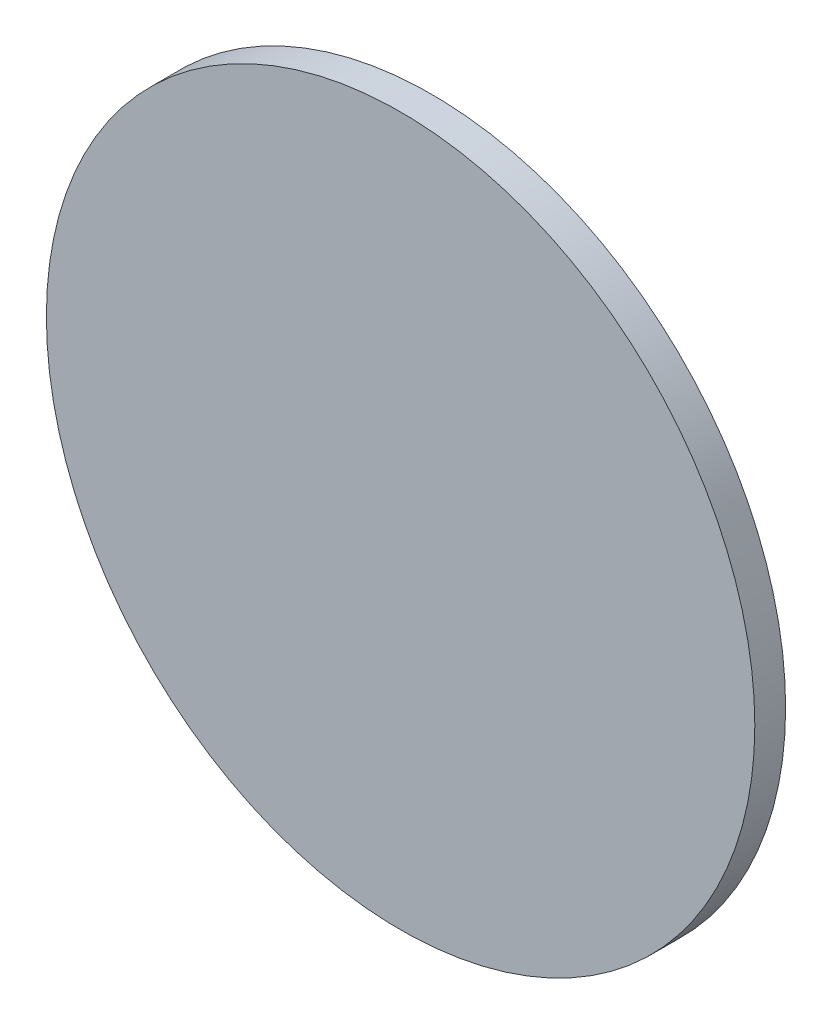
ISO-10303-21;
HEADER;
FILE_DESCRIPTION(('STEP AP214'),'2;1');
FILE_NAME('part.step','',(''),(''),'','','');
FILE_SCHEMA(('AUTOMOTIVE_DESIGN { 1 0 10303 214 1 1 1 1 }'));
ENDSEC;
DATA;
#1=APPLICATION_CONTEXT('core data for automotive mechanical design processes');
#2=APPLICATION_PROTOCOL_DEFINITION('international standard','automotive_design',2000,#1);
#3=PRODUCT_CONTEXT('',#1,'mechanical');
#4=PRODUCT('Part','Part','',(#3));
#5=PRODUCT_RELATED_PRODUCT_CATEGORY('part','',(#4));
#6=PRODUCT_DEFINITION_FORMATION('','',#4);
#7=PRODUCT_DEFINITION_CONTEXT('part definition',#1,'design');
#8=PRODUCT_DEFINITION('design','',#6,#7);
#9=PRODUCT_DEFINITION_SHAPE('','',#8);
#10=(LENGTH_UNIT() NAMED_UNIT(*) SI_UNIT(.MILLI.,.METRE.));
#11=(NAMED_UNIT(*) PLANE_ANGLE_UNIT() SI_UNIT($,.RADIAN.));
#12=(NAMED_UNIT(*) SI_UNIT($,.STERADIAN.) SOLID_ANGLE_UNIT());
#13=UNCERTAINTY_MEASURE_WITH_UNIT(LENGTH_MEASURE(1.E-05),#10,'distance_accuracy_value','');
#14=(GEOMETRIC_REPRESENTATION_CONTEXT(3) GLOBAL_UNCERTAINTY_ASSIGNED_CONTEXT((#13)) GLOBAL_UNIT_ASSIGNED_CONTEXT((#10,
#11,#12)) REPRESENTATION_CONTEXT('',''));
#15=CARTESIAN_POINT('',(0.,0.,0.));
#16=DIRECTION('',(0.,0.,1.));
#17=DIRECTION('',(1.,0.,0.));
#18=AXIS2_PLACEMENT_3D('',#15,#16,#17);
#19=CARTESIAN_POINT('',(0.,0.,2.));
#20=DIRECTION('',(0.,0.,-1.));
#21=DIRECTION('',(-1.,0.,0.));
#22=AXIS2_PLACEMENT_3D('',#19,#20,#21);
#23=CYLINDRICAL_SURFACE('',#22,23.);
#24=CARTESIAN_POINT('',(0.,0.,2.));
#25=DIRECTION('',(0.,0.,1.));
#26=DIRECTION('',(1.,0.,0.));
#27=AXIS2_PLACEMENT_3D('',#24,#25,#26);
#28=CIRCLE('',#27,23.);
#29=CARTESIAN_POINT('',(23.,0.,2.));
#30=VERTEX_POINT('',#29);
#31=EDGE_CURVE('E10',#30,#30,#28,.T.);
#32=ORIENTED_EDGE('',*,*,#31,.F.);
#33=EDGE_LOOP('',(#32));
#34=FACE_BOUND('',#33,.T.);
#35=CARTESIAN_POINT('',(0.,0.,0.));
#36=DIRECTION('',(0.,0.,1.));
#37=DIRECTION('',(1.,0.,0.));
#38=AXIS2_PLACEMENT_3D('',#35,#36,#37);
#39=CIRCLE('',#38,23.);
#40=CARTESIAN_POINT('',(23.,0.,0.));
#41=VERTEX_POINT('',#40);
#42=EDGE_CURVE('E36',#41,#41,#39,.T.);
#43=ORIENTED_EDGE('',*,*,#42,.T.);
#44=EDGE_LOOP('',(#43));
#45=FACE_BOUND('',#44,.T.);
#46=ADVANCED_FACE('F33',(#34,#45),#23,.T.);
#47=CARTESIAN_POINT('',(0.,0.,2.));
#48=DIRECTION('',(0.,0.,1.));
#49=DIRECTION('',(1.,0.,0.));
#50=AXIS2_PLACEMENT_3D('',#47,#48,#49);
#51=PLANE('',#50);
#52=ORIENTED_EDGE('',*,*,#31,.T.);
#53=EDGE_LOOP('',(#52));
#54=FACE_BOUND('',#53,.T.);
#55=ADVANCED_FACE('F48',(#54),#51,.T.);
#56=CARTESIAN_POINT('',(0.,0.,0.));
#57=DIRECTION('',(0.,0.,1.));
#58=DIRECTION('',(1.,0.,0.));
#59=AXIS2_PLACEMENT_3D('',#56,#57,#58);
#60=PLANE('',#59);
#61=ORIENTED_EDGE('',*,*,#42,.F.);
#62=EDGE_LOOP('',(#61));
#63=FACE_BOUND('',#62,.T.);
#64=ADVANCED_FACE('F46',(#63),#60,.F.);
#65=CLOSED_SHELL('',(#46,#55,#64));
#66=MANIFOLD_SOLID_BREP('B2',#65);
#67=ADVANCED_BREP_SHAPE_REPRESENTATION('',(#18,#66),#14);
#68=SHAPE_DEFINITION_REPRESENTATION(#9,#67);
ENDSEC;
END-ISO-10303-21;
